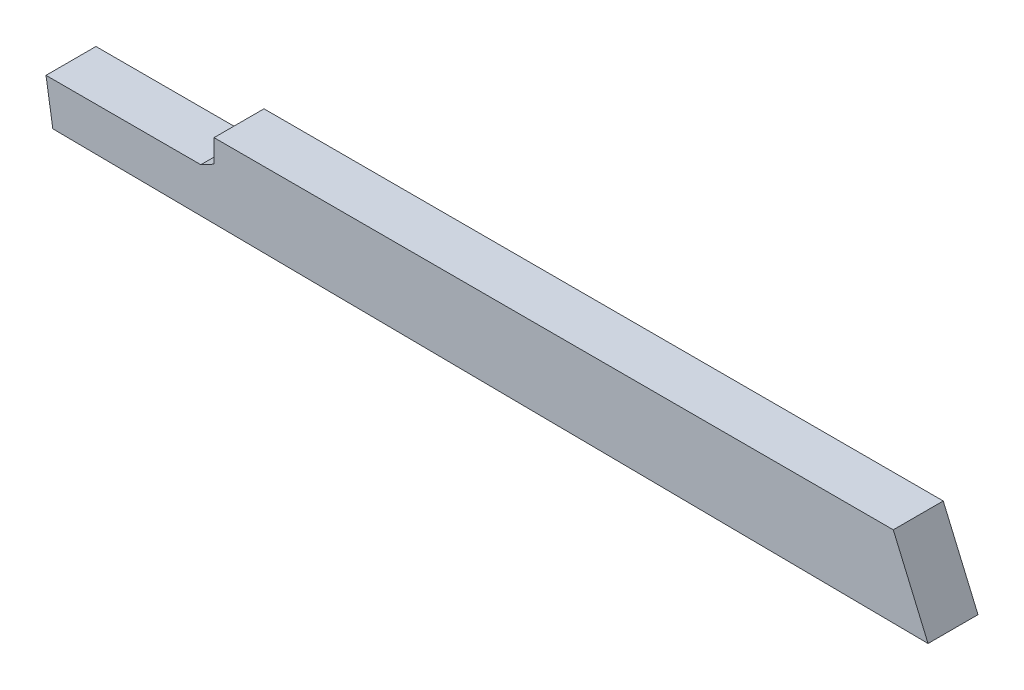
ISO-10303-21;
HEADER;
FILE_DESCRIPTION(('STEP AP214'),'2;1');
FILE_NAME('part.step','',(''),(''),'','','');
FILE_SCHEMA(('AUTOMOTIVE_DESIGN { 1 0 10303 214 1 1 1 1 }'));
ENDSEC;
DATA;
#1=APPLICATION_CONTEXT('core data for automotive mechanical design processes');
#2=APPLICATION_PROTOCOL_DEFINITION('international standard','automotive_design',2000,#1);
#3=PRODUCT_CONTEXT('',#1,'mechanical');
#4=PRODUCT('Part','Part','',(#3));
#5=PRODUCT_RELATED_PRODUCT_CATEGORY('part','',(#4));
#6=PRODUCT_DEFINITION_FORMATION('','',#4);
#7=PRODUCT_DEFINITION_CONTEXT('part definition',#1,'design');
#8=PRODUCT_DEFINITION('design','',#6,#7);
#9=PRODUCT_DEFINITION_SHAPE('','',#8);
#10=(LENGTH_UNIT() NAMED_UNIT(*) SI_UNIT(.MILLI.,.METRE.));
#11=(NAMED_UNIT(*) PLANE_ANGLE_UNIT() SI_UNIT($,.RADIAN.));
#12=(NAMED_UNIT(*) SI_UNIT($,.STERADIAN.) SOLID_ANGLE_UNIT());
#13=UNCERTAINTY_MEASURE_WITH_UNIT(LENGTH_MEASURE(1.E-05),#10,'distance_accuracy_value','');
#14=(GEOMETRIC_REPRESENTATION_CONTEXT(3) GLOBAL_UNCERTAINTY_ASSIGNED_CONTEXT((#13)) GLOBAL_UNIT_ASSIGNED_CONTEXT((#10,
#11,#12)) REPRESENTATION_CONTEXT('',''));
#15=CARTESIAN_POINT('',(0.,0.,0.));
#16=DIRECTION('',(0.,0.,1.));
#17=DIRECTION('',(1.,0.,0.));
#18=AXIS2_PLACEMENT_3D('',#15,#16,#17);
#19=CARTESIAN_POINT('',(0.,0.,2.54));
#20=DIRECTION('',(1.,0.,0.));
#21=DIRECTION('',(0.,1.,0.));
#22=AXIS2_PLACEMENT_3D('',#19,#20,#21);
#23=PLANE('',#22);
#24=DIRECTION('',(0.,-1.,0.));
#25=VECTOR('',#24,1.);
#26=CARTESIAN_POINT('',(0.,0.,0.));
#27=LINE('',#26,#25);
#28=CARTESIAN_POINT('',(0.,0.,0.));
#29=VERTEX_POINT('',#28);
#30=CARTESIAN_POINT('',(0.,-1.1684,0.));
#31=VERTEX_POINT('',#30);
#32=EDGE_CURVE('E126',#29,#31,#27,.T.);
#33=ORIENTED_EDGE('',*,*,#32,.T.);
#34=DIRECTION('',(0.,0.,-1.));
#35=VECTOR('',#34,1.);
#36=CARTESIAN_POINT('',(0.,-1.1684,2.54));
#37=LINE('',#36,#35);
#38=CARTESIAN_POINT('',(0.,-1.1684,2.54));
#39=VERTEX_POINT('',#38);
#40=EDGE_CURVE('E11',#39,#31,#37,.T.);
#41=ORIENTED_EDGE('',*,*,#40,.F.);
#42=DIRECTION('',(0.,-1.,0.));
#43=VECTOR('',#42,1.);
#44=CARTESIAN_POINT('',(0.,0.,2.54));
#45=LINE('',#44,#43);
#46=CARTESIAN_POINT('',(0.,0.,2.54));
#47=VERTEX_POINT('',#46);
#48=EDGE_CURVE('E138',#47,#39,#45,.T.);
#49=ORIENTED_EDGE('',*,*,#48,.F.);
#50=DIRECTION('',(0.,0.,-1.));
#51=VECTOR('',#50,1.);
#52=CARTESIAN_POINT('',(0.,0.,2.54));
#53=LINE('',#52,#51);
#54=EDGE_CURVE('E122',#47,#29,#53,.T.);
#55=ORIENTED_EDGE('',*,*,#54,.T.);
#56=EDGE_LOOP('',(#33,#41,#49,#55));
#57=FACE_BOUND('',#56,.T.);
#58=ADVANCED_FACE('F36',(#57),#23,.F.);
#59=CARTESIAN_POINT('',(0.,-1.1684,2.54));
#60=DIRECTION('',(0.472164640198931,-0.881510381416926,0.));
#61=DIRECTION('',(0.881510381416926,0.472164640198931,0.));
#62=AXIS2_PLACEMENT_3D('',#59,#60,#61);
#63=PLANE('',#62);
#64=DIRECTION('',(-0.881510381416926,-0.472164640198931,0.));
#65=VECTOR('',#64,1.);
#66=CARTESIAN_POINT('',(0.,-1.1684,0.));
#67=LINE('',#66,#65);
#68=CARTESIAN_POINT('',(-0.671710910639697,-1.52818945583159,0.));
#69=VERTEX_POINT('',#68);
#70=EDGE_CURVE('E129',#31,#69,#67,.T.);
#71=ORIENTED_EDGE('',*,*,#70,.T.);
#72=DIRECTION('',(0.,0.,-1.));
#73=VECTOR('',#72,1.);
#74=CARTESIAN_POINT('',(-0.671710910639697,-1.52818945583159,2.54));
#75=LINE('',#74,#73);
#76=CARTESIAN_POINT('',(-0.671710910639697,-1.52818945583159,2.54));
#77=VERTEX_POINT('',#76);
#78=EDGE_CURVE('E44',#77,#69,#75,.T.);
#79=ORIENTED_EDGE('',*,*,#78,.F.);
#80=DIRECTION('',(-0.881510381416926,-0.472164640198931,0.));
#81=VECTOR('',#80,1.);
#82=CARTESIAN_POINT('',(0.,-1.1684,2.54));
#83=LINE('',#82,#81);
#84=EDGE_CURVE('E92',#39,#77,#83,.T.);
#85=ORIENTED_EDGE('',*,*,#84,.F.);
#86=ORIENTED_EDGE('',*,*,#40,.T.);
#87=EDGE_LOOP('',(#71,#79,#85,#86));
#88=FACE_BOUND('',#87,.T.);
#89=ADVANCED_FACE('F163',(#88),#63,.F.);
#90=CARTESIAN_POINT('',(-0.671710910639697,-1.52818945583159,2.54));
#91=DIRECTION('',(0.,-1.,0.));
#92=DIRECTION('',(1.,0.,0.));
#93=AXIS2_PLACEMENT_3D('',#90,#91,#92);
#94=PLANE('',#93);
#95=DIRECTION('',(-1.,0.,0.));
#96=VECTOR('',#95,1.);
#97=CARTESIAN_POINT('',(-0.671710910639697,-1.52818945583159,0.));
#98=LINE('',#97,#96);
#99=CARTESIAN_POINT('',(-8.5457109106397,-1.52818945583159,0.));
#100=VERTEX_POINT('',#99);
#101=EDGE_CURVE('E131',#69,#100,#98,.T.);
#102=ORIENTED_EDGE('',*,*,#101,.T.);
#103=DIRECTION('',(0.,0.,-1.));
#104=VECTOR('',#103,1.);
#105=CARTESIAN_POINT('',(-8.5457109106397,-1.52818945583159,2.54));
#106=LINE('',#105,#104);
#107=CARTESIAN_POINT('',(-8.5457109106397,-1.52818945583159,2.54));
#108=VERTEX_POINT('',#107);
#109=EDGE_CURVE('E142',#108,#100,#106,.T.);
#110=ORIENTED_EDGE('',*,*,#109,.F.);
#111=DIRECTION('',(-1.,0.,0.));
#112=VECTOR('',#111,1.);
#113=CARTESIAN_POINT('',(-0.671710910639697,-1.52818945583159,2.54));
#114=LINE('',#113,#112);
#115=EDGE_CURVE('E150',#77,#108,#114,.T.);
#116=ORIENTED_EDGE('',*,*,#115,.F.);
#117=ORIENTED_EDGE('',*,*,#78,.T.);
#118=EDGE_LOOP('',(#102,#110,#116,#117));
#119=FACE_BOUND('',#118,.T.);
#120=ADVANCED_FACE('F148',(#119),#94,.F.);
#121=CARTESIAN_POINT('',(-8.5457109106397,-1.52818945583159,2.54));
#122=DIRECTION('',(0.987659109199851,0.156618913336025,0.));
#123=DIRECTION('',(-0.156618913336025,0.987659109199851,0.));
#124=AXIS2_PLACEMENT_3D('',#121,#122,#123);
#125=PLANE('',#124);
#126=DIRECTION('',(0.156618913336025,-0.987659109199851,0.));
#127=VECTOR('',#126,1.);
#128=CARTESIAN_POINT('',(-8.5457109106397,-1.52818945583159,0.));
#129=LINE('',#128,#127);
#130=CARTESIAN_POINT('',(-8.19961443594975,-3.71071855534142,0.));
#131=VERTEX_POINT('',#130);
#132=EDGE_CURVE('E133',#100,#131,#129,.T.);
#133=ORIENTED_EDGE('',*,*,#132,.T.);
#134=DIRECTION('',(0.,0.,-1.));
#135=VECTOR('',#134,1.);
#136=CARTESIAN_POINT('',(-8.19961443594975,-3.71071855534142,2.54));
#137=LINE('',#136,#135);
#138=CARTESIAN_POINT('',(-8.19961443594975,-3.71071855534142,2.54));
#139=VERTEX_POINT('',#138);
#140=EDGE_CURVE('E117',#139,#131,#137,.T.);
#141=ORIENTED_EDGE('',*,*,#140,.F.);
#142=DIRECTION('',(0.156618913336025,-0.987659109199851,0.));
#143=VECTOR('',#142,1.);
#144=CARTESIAN_POINT('',(-8.5457109106397,-1.52818945583159,2.54));
#145=LINE('',#144,#143);
#146=EDGE_CURVE('E108',#108,#139,#145,.T.);
#147=ORIENTED_EDGE('',*,*,#146,.F.);
#148=ORIENTED_EDGE('',*,*,#109,.T.);
#149=EDGE_LOOP('',(#133,#141,#147,#148));
#150=FACE_BOUND('',#149,.T.);
#151=ADVANCED_FACE('F156',(#150),#125,.F.);
#152=CARTESIAN_POINT('',(-8.19961443594975,-3.71071855534142,2.54));
#153=DIRECTION('',(0.00930536408958629,0.999956704162315,0.));
#154=DIRECTION('',(-0.999956704162316,0.00930536408958629,0.));
#155=AXIS2_PLACEMENT_3D('',#152,#153,#154);
#156=PLANE('',#155);
#157=DIRECTION('',(0.999956704162316,-0.00930536408958629,0.));
#158=VECTOR('',#157,1.);
#159=CARTESIAN_POINT('',(-8.19961443594975,-3.71071855534142,0.));
#160=LINE('',#159,#158);
#161=CARTESIAN_POINT('',(36.3122907017744,-4.12493597285914,0.));
#162=VERTEX_POINT('',#161);
#163=EDGE_CURVE('E116',#131,#162,#160,.T.);
#164=ORIENTED_EDGE('',*,*,#163,.T.);
#165=DIRECTION('',(0.,0.,-1.));
#166=VECTOR('',#165,1.);
#167=CARTESIAN_POINT('',(36.3122907017744,-4.12493597285914,2.54));
#168=LINE('',#167,#166);
#169=CARTESIAN_POINT('',(36.3122907017744,-4.12493597285914,2.54));
#170=VERTEX_POINT('',#169);
#171=EDGE_CURVE('E113',#170,#162,#168,.T.);
#172=ORIENTED_EDGE('',*,*,#171,.F.);
#173=DIRECTION('',(0.999956704162316,-0.00930536408958629,0.));
#174=VECTOR('',#173,1.);
#175=CARTESIAN_POINT('',(-8.19961443594975,-3.71071855534142,2.54));
#176=LINE('',#175,#174);
#177=EDGE_CURVE('E102',#139,#170,#176,.T.);
#178=ORIENTED_EDGE('',*,*,#177,.F.);
#179=ORIENTED_EDGE('',*,*,#140,.T.);
#180=EDGE_LOOP('',(#164,#172,#178,#179));
#181=FACE_BOUND('',#180,.T.);
#182=ADVANCED_FACE('F114',(#181),#156,.F.);
#183=CARTESIAN_POINT('',(34.544,0.,2.54));
#184=DIRECTION('',(-0.919107834681845,-0.39400607638265,0.));
#185=DIRECTION('',(0.39400607638265,-0.919107834681845,0.));
#186=AXIS2_PLACEMENT_3D('',#183,#184,#185);
#187=PLANE('',#186);
#188=DIRECTION('',(-0.39400607638265,0.919107834681845,0.));
#189=VECTOR('',#188,1.);
#190=CARTESIAN_POINT('',(34.544,0.,0.));
#191=LINE('',#190,#189);
#192=CARTESIAN_POINT('',(34.544,0.,0.));
#193=VERTEX_POINT('',#192);
#194=EDGE_CURVE('E78',#162,#193,#191,.T.);
#195=ORIENTED_EDGE('',*,*,#194,.T.);
#196=DIRECTION('',(0.,0.,-1.));
#197=VECTOR('',#196,1.);
#198=CARTESIAN_POINT('',(34.544,0.,2.54));
#199=LINE('',#198,#197);
#200=CARTESIAN_POINT('',(34.544,0.,2.54));
#201=VERTEX_POINT('',#200);
#202=EDGE_CURVE('E118',#201,#193,#199,.T.);
#203=ORIENTED_EDGE('',*,*,#202,.F.);
#204=DIRECTION('',(-0.39400607638265,0.919107834681845,0.));
#205=VECTOR('',#204,1.);
#206=CARTESIAN_POINT('',(34.544,0.,2.54));
#207=LINE('',#206,#205);
#208=EDGE_CURVE('E106',#170,#201,#207,.T.);
#209=ORIENTED_EDGE('',*,*,#208,.F.);
#210=ORIENTED_EDGE('',*,*,#171,.T.);
#211=EDGE_LOOP('',(#195,#203,#209,#210));
#212=FACE_BOUND('',#211,.T.);
#213=ADVANCED_FACE('F120',(#212),#187,.F.);
#214=CARTESIAN_POINT('',(0.,0.,2.54));
#215=DIRECTION('',(0.,-1.,0.));
#216=DIRECTION('',(0.,0.,-1.));
#217=AXIS2_PLACEMENT_3D('',#214,#215,#216);
#218=PLANE('',#217);
#219=DIRECTION('',(-1.,0.,0.));
#220=VECTOR('',#219,1.);
#221=CARTESIAN_POINT('',(0.,0.,0.));
#222=LINE('',#221,#220);
#223=EDGE_CURVE('E84',#193,#29,#222,.T.);
#224=ORIENTED_EDGE('',*,*,#223,.T.);
#225=ORIENTED_EDGE('',*,*,#54,.F.);
#226=DIRECTION('',(-1.,0.,0.));
#227=VECTOR('',#226,1.);
#228=CARTESIAN_POINT('',(0.,0.,2.54));
#229=LINE('',#228,#227);
#230=EDGE_CURVE('E52',#201,#47,#229,.T.);
#231=ORIENTED_EDGE('',*,*,#230,.F.);
#232=ORIENTED_EDGE('',*,*,#202,.T.);
#233=EDGE_LOOP('',(#224,#225,#231,#232));
#234=FACE_BOUND('',#233,.T.);
#235=ADVANCED_FACE('F177',(#234),#218,.F.);
#236=CARTESIAN_POINT('',(0.,0.,2.54));
#237=DIRECTION('',(0.,0.,-1.));
#238=DIRECTION('',(-1.,0.,0.));
#239=AXIS2_PLACEMENT_3D('',#236,#237,#238);
#240=PLANE('',#239);
#241=ORIENTED_EDGE('',*,*,#48,.T.);
#242=ORIENTED_EDGE('',*,*,#84,.T.);
#243=ORIENTED_EDGE('',*,*,#115,.T.);
#244=ORIENTED_EDGE('',*,*,#146,.T.);
#245=ORIENTED_EDGE('',*,*,#177,.T.);
#246=ORIENTED_EDGE('',*,*,#208,.T.);
#247=ORIENTED_EDGE('',*,*,#230,.T.);
#248=EDGE_LOOP('',(#241,#242,#243,#244,#245,#246,#247));
#249=FACE_BOUND('',#248,.T.);
#250=ADVANCED_FACE('F104',(#249),#240,.F.);
#251=CARTESIAN_POINT('',(0.,0.,0.));
#252=DIRECTION('',(0.,0.,-1.));
#253=DIRECTION('',(-1.,0.,0.));
#254=AXIS2_PLACEMENT_3D('',#251,#252,#253);
#255=PLANE('',#254);
#256=ORIENTED_EDGE('',*,*,#32,.F.);
#257=ORIENTED_EDGE('',*,*,#223,.F.);
#258=ORIENTED_EDGE('',*,*,#194,.F.);
#259=ORIENTED_EDGE('',*,*,#163,.F.);
#260=ORIENTED_EDGE('',*,*,#132,.F.);
#261=ORIENTED_EDGE('',*,*,#101,.F.);
#262=ORIENTED_EDGE('',*,*,#70,.F.);
#263=EDGE_LOOP('',(#256,#257,#258,#259,#260,#261,#262));
#264=FACE_BOUND('',#263,.T.);
#265=ADVANCED_FACE('F154',(#264),#255,.T.);
#266=CLOSED_SHELL('',(#58,#89,#120,#151,#182,#213,#235,#250,#265));
#267=MANIFOLD_SOLID_BREP('B2',#266);
#268=ADVANCED_BREP_SHAPE_REPRESENTATION('',(#18,#267),#14);
#269=SHAPE_DEFINITION_REPRESENTATION(#9,#268);
ENDSEC;
END-ISO-10303-21;
